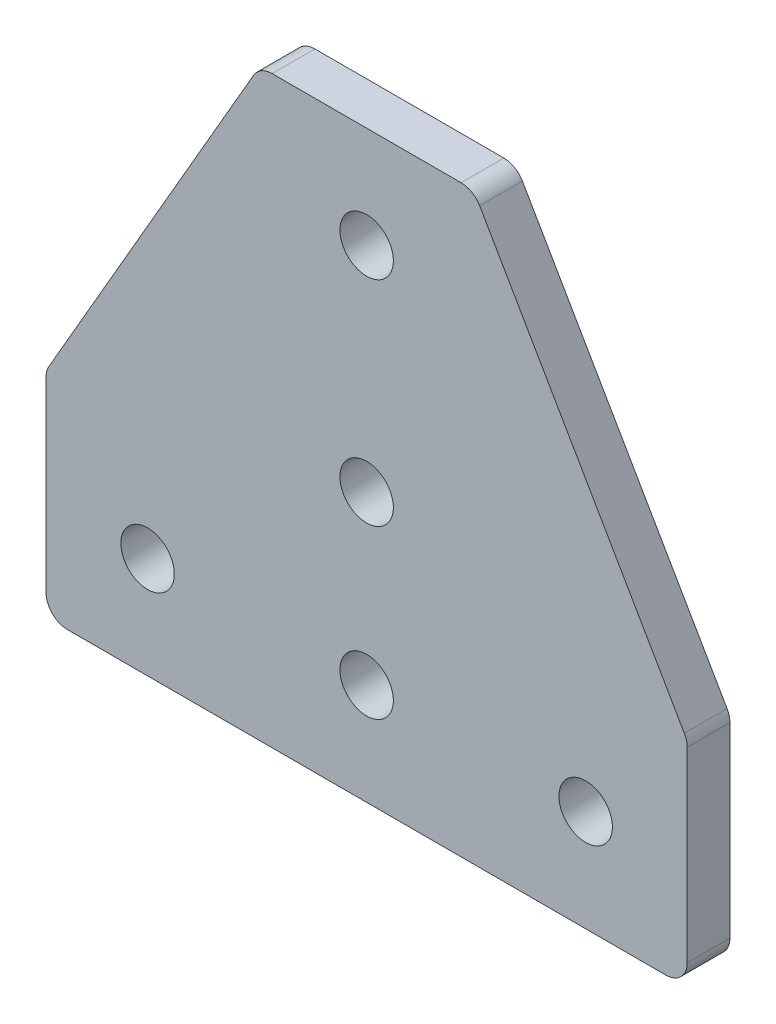
ISO-10303-21;
HEADER;
FILE_DESCRIPTION(('STEP AP214'),'2;1');
FILE_NAME('part.step','',(''),(''),'','','');
FILE_SCHEMA(('AUTOMOTIVE_DESIGN { 1 0 10303 214 1 1 1 1 }'));
ENDSEC;
DATA;
#1=APPLICATION_CONTEXT('core data for automotive mechanical design processes');
#2=APPLICATION_PROTOCOL_DEFINITION('international standard','automotive_design',2000,#1);
#3=PRODUCT_CONTEXT('',#1,'mechanical');
#4=PRODUCT('Part','Part','',(#3));
#5=PRODUCT_RELATED_PRODUCT_CATEGORY('part','',(#4));
#6=PRODUCT_DEFINITION_FORMATION('','',#4);
#7=PRODUCT_DEFINITION_CONTEXT('part definition',#1,'design');
#8=PRODUCT_DEFINITION('design','',#6,#7);
#9=PRODUCT_DEFINITION_SHAPE('','',#8);
#10=(LENGTH_UNIT() NAMED_UNIT(*) SI_UNIT(.MILLI.,.METRE.));
#11=(NAMED_UNIT(*) PLANE_ANGLE_UNIT() SI_UNIT($,.RADIAN.));
#12=(NAMED_UNIT(*) SI_UNIT($,.STERADIAN.) SOLID_ANGLE_UNIT());
#13=UNCERTAINTY_MEASURE_WITH_UNIT(LENGTH_MEASURE(1.E-05),#10,'distance_accuracy_value','');
#14=(GEOMETRIC_REPRESENTATION_CONTEXT(3) GLOBAL_UNCERTAINTY_ASSIGNED_CONTEXT((#13)) GLOBAL_UNIT_ASSIGNED_CONTEXT((#10,
#11,#12)) REPRESENTATION_CONTEXT('',''));
#15=CARTESIAN_POINT('',(0.,0.,0.));
#16=DIRECTION('',(0.,0.,1.));
#17=DIRECTION('',(1.,0.,0.));
#18=AXIS2_PLACEMENT_3D('',#15,#16,#17);
#19=CARTESIAN_POINT('',(-2.12462870860008,-24.3958817984257,1.20047772650378));
#20=DIRECTION('',(0.,1.,0.));
#21=DIRECTION('',(-1.,0.,0.));
#22=AXIS2_PLACEMENT_3D('',#19,#20,#21);
#23=PLANE('',#22);
#24=DIRECTION('',(1.,0.,0.));
#25=VECTOR('',#24,1.);
#26=CARTESIAN_POINT('',(-2.12462870860008,-24.3958817984257,-2.79952227349622));
#27=LINE('',#26,#25);
#28=CARTESIAN_POINT('',(-30.1246287086001,-24.3958817984257,-2.79952227349622));
#29=VERTEX_POINT('',#28);
#30=CARTESIAN_POINT('',(25.8753712913999,-24.3958817984257,-2.79952227349622));
#31=VERTEX_POINT('',#30);
#32=EDGE_CURVE('E202',#29,#31,#27,.T.);
#33=ORIENTED_EDGE('',*,*,#32,.T.);
#34=DIRECTION('',(0.,0.,-1.));
#35=VECTOR('',#34,1.);
#36=CARTESIAN_POINT('',(25.8753712913999,-24.3958817984257,1.20047772650378));
#37=LINE('',#36,#35);
#38=CARTESIAN_POINT('',(25.8753712913999,-24.3958817984257,1.20047772650378));
#39=VERTEX_POINT('',#38);
#40=EDGE_CURVE('E127',#31,#39,#37,.F.);
#41=ORIENTED_EDGE('',*,*,#40,.T.);
#42=DIRECTION('',(1.,0.,0.));
#43=VECTOR('',#42,1.);
#44=CARTESIAN_POINT('',(-2.12462870860008,-24.3958817984257,1.20047772650378));
#45=LINE('',#44,#43);
#46=CARTESIAN_POINT('',(-30.1246287086001,-24.3958817984257,1.20047772650378));
#47=VERTEX_POINT('',#46);
#48=EDGE_CURVE('E197',#47,#39,#45,.T.);
#49=ORIENTED_EDGE('',*,*,#48,.F.);
#50=DIRECTION('',(0.,0.,-1.));
#51=VECTOR('',#50,1.);
#52=CARTESIAN_POINT('',(-30.1246287086001,-24.3958817984257,1.20047772650378));
#53=LINE('',#52,#51);
#54=EDGE_CURVE('E128',#47,#29,#53,.T.);
#55=ORIENTED_EDGE('',*,*,#54,.T.);
#56=EDGE_LOOP('',(#33,#41,#49,#55));
#57=FACE_BOUND('',#56,.T.);
#58=ADVANCED_FACE('F16',(#57),#23,.F.);
#59=CARTESIAN_POINT('',(-12.1246287086001,30.2451343529519,1.20047772650378));
#60=DIRECTION('',(0.,-1.,0.));
#61=DIRECTION('',(0.,0.,-1.));
#62=AXIS2_PLACEMENT_3D('',#59,#60,#61);
#63=PLANE('',#62);
#64=DIRECTION('',(-1.,0.,0.));
#65=VECTOR('',#64,1.);
#66=CARTESIAN_POINT('',(-12.1246287086001,30.2451343529519,-2.79952227349622));
#67=LINE('',#66,#65);
#68=CARTESIAN_POINT('',(6.72067075302066,30.2451343529519,-2.79952227349622));
#69=VERTEX_POINT('',#68);
#70=CARTESIAN_POINT('',(-10.9699281702208,30.2451343529519,-2.79952227349622));
#71=VERTEX_POINT('',#70);
#72=EDGE_CURVE('E204',#69,#71,#67,.T.);
#73=ORIENTED_EDGE('',*,*,#72,.T.);
#74=DIRECTION('',(0.,0.,-1.));
#75=VECTOR('',#74,1.);
#76=CARTESIAN_POINT('',(-10.9699281702208,30.2451343529519,1.20047772650378));
#77=LINE('',#76,#75);
#78=CARTESIAN_POINT('',(-10.9699281702208,30.2451343529519,1.20047772650378));
#79=VERTEX_POINT('',#78);
#80=EDGE_CURVE('E169',#71,#79,#77,.F.);
#81=ORIENTED_EDGE('',*,*,#80,.T.);
#82=DIRECTION('',(-1.,0.,0.));
#83=VECTOR('',#82,1.);
#84=CARTESIAN_POINT('',(-12.1246287086001,30.2451343529519,1.20047772650378));
#85=LINE('',#84,#83);
#86=CARTESIAN_POINT('',(6.72067075302066,30.2451343529519,1.20047772650378));
#87=VERTEX_POINT('',#86);
#88=EDGE_CURVE('E199',#87,#79,#85,.T.);
#89=ORIENTED_EDGE('',*,*,#88,.F.);
#90=DIRECTION('',(0.,0.,-1.));
#91=VECTOR('',#90,1.);
#92=CARTESIAN_POINT('',(6.72067075302066,30.2451343529519,-2.79952227349622));
#93=LINE('',#92,#91);
#94=EDGE_CURVE('E166',#87,#69,#93,.T.);
#95=ORIENTED_EDGE('',*,*,#94,.T.);
#96=EDGE_LOOP('',(#73,#81,#89,#95));
#97=FACE_BOUND('',#96,.T.);
#98=ADVANCED_FACE('F222',(#97),#63,.F.);
#99=CARTESIAN_POINT('',(-32.1246287086001,-4.39588179842569,1.20047772650378));
#100=DIRECTION('',(0.866025403784439,-0.5,0.));
#101=DIRECTION('',(0.5,0.866025403784439,0.));
#102=AXIS2_PLACEMENT_3D('',#99,#100,#101);
#103=PLANE('',#102);
#104=DIRECTION('',(-0.5,-0.866025403784439,0.));
#105=VECTOR('',#104,1.);
#106=CARTESIAN_POINT('',(-32.1246287086001,-4.39588179842569,1.20047772650378));
#107=LINE('',#106,#105);
#108=CARTESIAN_POINT('',(-12.7019789777897,29.2451343529518,1.20047772650378));
#109=VERTEX_POINT('',#108);
#110=CARTESIAN_POINT('',(-31.856679516169,-3.93178018328793,1.20047772650378));
#111=VERTEX_POINT('',#110);
#112=EDGE_CURVE('E138',#109,#111,#107,.T.);
#113=ORIENTED_EDGE('',*,*,#112,.F.);
#114=DIRECTION('',(0.,0.,-1.));
#115=VECTOR('',#114,1.);
#116=CARTESIAN_POINT('',(-12.7019789777897,29.2451343529519,1.20047772650378));
#117=LINE('',#116,#115);
#118=CARTESIAN_POINT('',(-12.7019789777897,29.2451343529518,-2.79952227349622));
#119=VERTEX_POINT('',#118);
#120=EDGE_CURVE('E156',#109,#119,#117,.T.);
#121=ORIENTED_EDGE('',*,*,#120,.T.);
#122=DIRECTION('',(-0.5,-0.866025403784439,0.));
#123=VECTOR('',#122,1.);
#124=CARTESIAN_POINT('',(-32.1246287086001,-4.39588179842569,-2.79952227349622));
#125=LINE('',#124,#123);
#126=CARTESIAN_POINT('',(-31.856679516169,-3.93178018328793,-2.79952227349622));
#127=VERTEX_POINT('',#126);
#128=EDGE_CURVE('E206',#119,#127,#125,.T.);
#129=ORIENTED_EDGE('',*,*,#128,.T.);
#130=DIRECTION('',(0.,0.,-1.));
#131=VECTOR('',#130,1.);
#132=CARTESIAN_POINT('',(-31.856679516169,-3.93178018328793,1.20047772650378));
#133=LINE('',#132,#131);
#134=EDGE_CURVE('E154',#127,#111,#133,.F.);
#135=ORIENTED_EDGE('',*,*,#134,.T.);
#136=EDGE_LOOP('',(#113,#121,#129,#135));
#137=FACE_BOUND('',#136,.T.);
#138=ADVANCED_FACE('F228',(#137),#103,.F.);
#139=CARTESIAN_POINT('',(-32.1246287086001,-24.3958817984257,1.20047772650378));
#140=DIRECTION('',(1.,0.,0.));
#141=DIRECTION('',(0.,0.,-1.));
#142=AXIS2_PLACEMENT_3D('',#139,#140,#141);
#143=PLANE('',#142);
#144=DIRECTION('',(0.,-1.,0.));
#145=VECTOR('',#144,1.);
#146=CARTESIAN_POINT('',(-32.1246287086001,-24.3958817984257,1.20047772650378));
#147=LINE('',#146,#145);
#148=CARTESIAN_POINT('',(-32.1246287086001,-4.93178018328793,1.20047772650378));
#149=VERTEX_POINT('',#148);
#150=CARTESIAN_POINT('',(-32.1246287086001,-22.3958817984257,1.20047772650378));
#151=VERTEX_POINT('',#150);
#152=EDGE_CURVE('E134',#149,#151,#147,.T.);
#153=ORIENTED_EDGE('',*,*,#152,.F.);
#154=DIRECTION('',(0.,0.,-1.));
#155=VECTOR('',#154,1.);
#156=CARTESIAN_POINT('',(-32.1246287086001,-4.93178018328793,1.20047772650378));
#157=LINE('',#156,#155);
#158=CARTESIAN_POINT('',(-32.1246287086001,-4.93178018328793,-2.79952227349622));
#159=VERTEX_POINT('',#158);
#160=EDGE_CURVE('E10',#149,#159,#157,.T.);
#161=ORIENTED_EDGE('',*,*,#160,.T.);
#162=DIRECTION('',(0.,-1.,0.));
#163=VECTOR('',#162,1.);
#164=CARTESIAN_POINT('',(-32.1246287086001,-24.3958817984257,-2.79952227349622));
#165=LINE('',#164,#163);
#166=CARTESIAN_POINT('',(-32.1246287086001,-22.3958817984257,-2.79952227349622));
#167=VERTEX_POINT('',#166);
#168=EDGE_CURVE('E141',#159,#167,#165,.T.);
#169=ORIENTED_EDGE('',*,*,#168,.T.);
#170=DIRECTION('',(0.,0.,-1.));
#171=VECTOR('',#170,1.);
#172=CARTESIAN_POINT('',(-32.1246287086001,-22.3958817984257,1.20047772650378));
#173=LINE('',#172,#171);
#174=EDGE_CURVE('E151',#167,#151,#173,.F.);
#175=ORIENTED_EDGE('',*,*,#174,.T.);
#176=EDGE_LOOP('',(#153,#161,#169,#175));
#177=FACE_BOUND('',#176,.T.);
#178=ADVANCED_FACE('F212',(#177),#143,.F.);
#179=CARTESIAN_POINT('',(-32.1246287086001,-24.3958817984257,1.20047772650378));
#180=DIRECTION('',(0.,0.,-1.));
#181=DIRECTION('',(-1.,0.,0.));
#182=AXIS2_PLACEMENT_3D('',#179,#180,#181);
#183=PLANE('',#182);
#184=CARTESIAN_POINT('',(-2.12462870860008,20.7451343529519,1.20047772650378));
#185=DIRECTION('',(0.,0.,-1.));
#186=DIRECTION('',(-1.,0.,0.));
#187=AXIS2_PLACEMENT_3D('',#184,#185,#186);
#188=CIRCLE('',#187,2.5);
#189=CARTESIAN_POINT('',(-4.62462870860008,20.7451343529519,1.20047772650378));
#190=VERTEX_POINT('',#189);
#191=EDGE_CURVE('E318',#190,#190,#188,.T.);
#192=ORIENTED_EDGE('',*,*,#191,.T.);
#193=EDGE_LOOP('',(#192));
#194=FACE_BOUND('',#193,.T.);
#195=CARTESIAN_POINT('',(-2.12462870860008,0.745134352951864,1.20047772650378));
#196=DIRECTION('',(0.,0.,-1.));
#197=DIRECTION('',(-1.,0.,0.));
#198=AXIS2_PLACEMENT_3D('',#195,#196,#197);
#199=CIRCLE('',#198,2.5);
#200=CARTESIAN_POINT('',(-4.62462870860008,0.745134352951864,1.20047772650378));
#201=VERTEX_POINT('',#200);
#202=EDGE_CURVE('E312',#201,#201,#199,.T.);
#203=ORIENTED_EDGE('',*,*,#202,.T.);
#204=EDGE_LOOP('',(#203));
#205=FACE_BOUND('',#204,.T.);
#206=CARTESIAN_POINT('',(18.3753712913999,-14.8958817984257,1.20047772650378));
#207=DIRECTION('',(0.,0.,-1.));
#208=DIRECTION('',(-1.,0.,0.));
#209=AXIS2_PLACEMENT_3D('',#206,#207,#208);
#210=CIRCLE('',#209,2.5);
#211=CARTESIAN_POINT('',(15.8753712913999,-14.8958817984257,1.20047772650378));
#212=VERTEX_POINT('',#211);
#213=EDGE_CURVE('E302',#212,#212,#210,.T.);
#214=ORIENTED_EDGE('',*,*,#213,.T.);
#215=EDGE_LOOP('',(#214));
#216=FACE_BOUND('',#215,.T.);
#217=CARTESIAN_POINT('',(-22.6246287086001,-14.8958817984257,1.20047772650378));
#218=DIRECTION('',(0.,0.,-1.));
#219=DIRECTION('',(-1.,0.,0.));
#220=AXIS2_PLACEMENT_3D('',#217,#218,#219);
#221=CIRCLE('',#220,2.5);
#222=CARTESIAN_POINT('',(-25.1246287086001,-14.8958817984257,1.20047772650378));
#223=VERTEX_POINT('',#222);
#224=EDGE_CURVE('E297',#223,#223,#221,.T.);
#225=ORIENTED_EDGE('',*,*,#224,.T.);
#226=EDGE_LOOP('',(#225));
#227=FACE_BOUND('',#226,.T.);
#228=CARTESIAN_POINT('',(-2.12462870860008,-14.8958817984257,1.20047772650378));
#229=DIRECTION('',(0.,0.,-1.));
#230=DIRECTION('',(-1.,0.,0.));
#231=AXIS2_PLACEMENT_3D('',#228,#229,#230);
#232=CIRCLE('',#231,2.5);
#233=CARTESIAN_POINT('',(-4.62462870860008,-14.8958817984257,1.20047772650378));
#234=VERTEX_POINT('',#233);
#235=EDGE_CURVE('E119',#234,#234,#232,.T.);
#236=ORIENTED_EDGE('',*,*,#235,.T.);
#237=EDGE_LOOP('',(#236));
#238=FACE_BOUND('',#237,.T.);
#239=ORIENTED_EDGE('',*,*,#88,.T.);
#240=CARTESIAN_POINT('',(-10.9699281702208,28.2451343529519,1.20047772650378));
#241=DIRECTION('',(0.,0.,-1.));
#242=DIRECTION('',(-1.,0.,0.));
#243=AXIS2_PLACEMENT_3D('',#240,#241,#242);
#244=CIRCLE('',#243,2.);
#245=EDGE_CURVE('E175',#79,#109,#244,.F.);
#246=ORIENTED_EDGE('',*,*,#245,.T.);
#247=ORIENTED_EDGE('',*,*,#112,.T.);
#248=CARTESIAN_POINT('',(-30.1246287086001,-4.93178018328793,1.20047772650378));
#249=DIRECTION('',(0.,0.,-1.));
#250=DIRECTION('',(-1.,0.,0.));
#251=AXIS2_PLACEMENT_3D('',#248,#249,#250);
#252=CIRCLE('',#251,2.);
#253=EDGE_CURVE('E31',#111,#149,#252,.F.);
#254=ORIENTED_EDGE('',*,*,#253,.T.);
#255=ORIENTED_EDGE('',*,*,#152,.T.);
#256=CARTESIAN_POINT('',(-30.1246287086001,-22.3958817984257,1.20047772650378));
#257=DIRECTION('',(0.,0.,-1.));
#258=DIRECTION('',(-1.,0.,0.));
#259=AXIS2_PLACEMENT_3D('',#256,#257,#258);
#260=CIRCLE('',#259,2.);
#261=EDGE_CURVE('E147',#151,#47,#260,.F.);
#262=ORIENTED_EDGE('',*,*,#261,.T.);
#263=ORIENTED_EDGE('',*,*,#48,.T.);
#264=CARTESIAN_POINT('',(25.8753712913999,-22.3958817984257,1.20047772650378));
#265=DIRECTION('',(0.,0.,-1.));
#266=DIRECTION('',(-1.,0.,0.));
#267=AXIS2_PLACEMENT_3D('',#264,#265,#266);
#268=CIRCLE('',#267,2.);
#269=CARTESIAN_POINT('',(27.8753712913999,-22.3958817984257,1.20047772650378));
#270=VERTEX_POINT('',#269);
#271=EDGE_CURVE('E149',#39,#270,#268,.F.);
#272=ORIENTED_EDGE('',*,*,#271,.T.);
#273=DIRECTION('',(0.,-1.,0.));
#274=VECTOR('',#273,1.);
#275=CARTESIAN_POINT('',(27.8753712913999,-24.3958817984257,1.20047772650378));
#276=LINE('',#275,#274);
#277=CARTESIAN_POINT('',(27.8753712913999,-4.93178018328793,1.20047772650378));
#278=VERTEX_POINT('',#277);
#279=EDGE_CURVE('E132',#278,#270,#276,.T.);
#280=ORIENTED_EDGE('',*,*,#279,.F.);
#281=CARTESIAN_POINT('',(25.8753712913999,-4.93178018328793,1.20047772650378));
#282=DIRECTION('',(0.,0.,-1.));
#283=DIRECTION('',(-1.,0.,0.));
#284=AXIS2_PLACEMENT_3D('',#281,#282,#283);
#285=CIRCLE('',#284,2.);
#286=CARTESIAN_POINT('',(27.6074220989688,-3.93178018328793,1.20047772650378));
#287=VERTEX_POINT('',#286);
#288=EDGE_CURVE('E38',#278,#287,#285,.F.);
#289=ORIENTED_EDGE('',*,*,#288,.T.);
#290=DIRECTION('',(0.5,-0.866025403784439,0.));
#291=VECTOR('',#290,1.);
#292=CARTESIAN_POINT('',(27.8753712913999,-4.39588179842569,1.20047772650378));
#293=LINE('',#292,#291);
#294=CARTESIAN_POINT('',(8.45272156058954,29.2451343529518,1.20047772650378));
#295=VERTEX_POINT('',#294);
#296=EDGE_CURVE('E185',#295,#287,#293,.T.);
#297=ORIENTED_EDGE('',*,*,#296,.F.);
#298=CARTESIAN_POINT('',(6.72067075302066,28.2451343529519,1.20047772650378));
#299=DIRECTION('',(0.,0.,-1.));
#300=DIRECTION('',(-1.,0.,0.));
#301=AXIS2_PLACEMENT_3D('',#298,#299,#300);
#302=CIRCLE('',#301,2.);
#303=EDGE_CURVE('E173',#295,#87,#302,.F.);
#304=ORIENTED_EDGE('',*,*,#303,.T.);
#305=EDGE_LOOP('',(#239,#246,#247,#254,#255,#262,#263,#272,#280,#289,#297,#304));
#306=FACE_BOUND('',#305,.T.);
#307=ADVANCED_FACE('F183',(#194,#205,#216,#227,#238,#306),#183,.F.);
#308=CARTESIAN_POINT('',(-32.1246287086001,-24.3958817984257,-2.79952227349622));
#309=DIRECTION('',(0.,0.,-1.));
#310=DIRECTION('',(-1.,0.,0.));
#311=AXIS2_PLACEMENT_3D('',#308,#309,#310);
#312=PLANE('',#311);
#313=CARTESIAN_POINT('',(-2.12462870860008,20.7451343529519,-2.79952227349622));
#314=DIRECTION('',(0.,0.,-1.));
#315=DIRECTION('',(-1.,0.,0.));
#316=AXIS2_PLACEMENT_3D('',#313,#314,#315);
#317=CIRCLE('',#316,2.5);
#318=CARTESIAN_POINT('',(-4.62462870860008,20.7451343529519,-2.79952227349622));
#319=VERTEX_POINT('',#318);
#320=EDGE_CURVE('E321',#319,#319,#317,.T.);
#321=ORIENTED_EDGE('',*,*,#320,.F.);
#322=EDGE_LOOP('',(#321));
#323=FACE_BOUND('',#322,.T.);
#324=CARTESIAN_POINT('',(-2.12462870860008,0.745134352951864,-2.79952227349622));
#325=DIRECTION('',(0.,0.,-1.));
#326=DIRECTION('',(-1.,0.,0.));
#327=AXIS2_PLACEMENT_3D('',#324,#325,#326);
#328=CIRCLE('',#327,2.5);
#329=CARTESIAN_POINT('',(-4.62462870860008,0.745134352951864,-2.79952227349622));
#330=VERTEX_POINT('',#329);
#331=EDGE_CURVE('E315',#330,#330,#328,.T.);
#332=ORIENTED_EDGE('',*,*,#331,.F.);
#333=EDGE_LOOP('',(#332));
#334=FACE_BOUND('',#333,.T.);
#335=CARTESIAN_POINT('',(18.3753712913999,-14.8958817984257,-2.79952227349622));
#336=DIRECTION('',(0.,0.,-1.));
#337=DIRECTION('',(-1.,0.,0.));
#338=AXIS2_PLACEMENT_3D('',#335,#336,#337);
#339=CIRCLE('',#338,2.5);
#340=CARTESIAN_POINT('',(15.8753712913999,-14.8958817984257,-2.79952227349622));
#341=VERTEX_POINT('',#340);
#342=EDGE_CURVE('E307',#341,#341,#339,.T.);
#343=ORIENTED_EDGE('',*,*,#342,.F.);
#344=EDGE_LOOP('',(#343));
#345=FACE_BOUND('',#344,.T.);
#346=CARTESIAN_POINT('',(-22.6246287086001,-14.8958817984257,-2.79952227349622));
#347=DIRECTION('',(0.,0.,-1.));
#348=DIRECTION('',(-1.,0.,0.));
#349=AXIS2_PLACEMENT_3D('',#346,#347,#348);
#350=CIRCLE('',#349,2.5);
#351=CARTESIAN_POINT('',(-25.1246287086001,-14.8958817984257,-2.79952227349622));
#352=VERTEX_POINT('',#351);
#353=EDGE_CURVE('E300',#352,#352,#350,.T.);
#354=ORIENTED_EDGE('',*,*,#353,.F.);
#355=EDGE_LOOP('',(#354));
#356=FACE_BOUND('',#355,.T.);
#357=CARTESIAN_POINT('',(-2.12462870860008,-14.8958817984257,-2.79952227349622));
#358=DIRECTION('',(0.,0.,-1.));
#359=DIRECTION('',(-1.,0.,0.));
#360=AXIS2_PLACEMENT_3D('',#357,#358,#359);
#361=CIRCLE('',#360,2.5);
#362=CARTESIAN_POINT('',(-4.62462870860008,-14.8958817984257,-2.79952227349622));
#363=VERTEX_POINT('',#362);
#364=EDGE_CURVE('E304',#363,#363,#361,.T.);
#365=ORIENTED_EDGE('',*,*,#364,.F.);
#366=EDGE_LOOP('',(#365));
#367=FACE_BOUND('',#366,.T.);
#368=ORIENTED_EDGE('',*,*,#128,.F.);
#369=CARTESIAN_POINT('',(-10.9699281702208,28.2451343529519,-2.79952227349622));
#370=DIRECTION('',(0.,0.,-1.));
#371=DIRECTION('',(-1.,0.,0.));
#372=AXIS2_PLACEMENT_3D('',#369,#370,#371);
#373=CIRCLE('',#372,2.);
#374=EDGE_CURVE('E164',#119,#71,#373,.T.);
#375=ORIENTED_EDGE('',*,*,#374,.T.);
#376=ORIENTED_EDGE('',*,*,#72,.F.);
#377=CARTESIAN_POINT('',(6.72067075302066,28.2451343529519,-2.79952227349622));
#378=DIRECTION('',(0.,0.,-1.));
#379=DIRECTION('',(-1.,0.,0.));
#380=AXIS2_PLACEMENT_3D('',#377,#378,#379);
#381=CIRCLE('',#380,2.);
#382=CARTESIAN_POINT('',(8.45272156058954,29.2451343529518,-2.79952227349622));
#383=VERTEX_POINT('',#382);
#384=EDGE_CURVE('E162',#69,#383,#381,.T.);
#385=ORIENTED_EDGE('',*,*,#384,.T.);
#386=DIRECTION('',(0.5,-0.866025403784439,0.));
#387=VECTOR('',#386,1.);
#388=CARTESIAN_POINT('',(27.8753712913999,-4.39588179842569,-2.79952227349622));
#389=LINE('',#388,#387);
#390=CARTESIAN_POINT('',(27.6074220989688,-3.93178018328793,-2.79952227349622));
#391=VERTEX_POINT('',#390);
#392=EDGE_CURVE('E118',#383,#391,#389,.T.);
#393=ORIENTED_EDGE('',*,*,#392,.T.);
#394=CARTESIAN_POINT('',(25.8753712913999,-4.93178018328793,-2.79952227349622));
#395=DIRECTION('',(0.,0.,-1.));
#396=DIRECTION('',(-1.,0.,0.));
#397=AXIS2_PLACEMENT_3D('',#394,#395,#396);
#398=CIRCLE('',#397,2.);
#399=CARTESIAN_POINT('',(27.8753712913999,-4.93178018328793,-2.79952227349622));
#400=VERTEX_POINT('',#399);
#401=EDGE_CURVE('E114',#391,#400,#398,.T.);
#402=ORIENTED_EDGE('',*,*,#401,.T.);
#403=DIRECTION('',(0.,-1.,0.));
#404=VECTOR('',#403,1.);
#405=CARTESIAN_POINT('',(27.8753712913999,-24.3958817984257,-2.79952227349622));
#406=LINE('',#405,#404);
#407=CARTESIAN_POINT('',(27.8753712913999,-22.3958817984257,-2.79952227349622));
#408=VERTEX_POINT('',#407);
#409=EDGE_CURVE('E106',#400,#408,#406,.T.);
#410=ORIENTED_EDGE('',*,*,#409,.T.);
#411=CARTESIAN_POINT('',(25.8753712913999,-22.3958817984257,-2.79952227349622));
#412=DIRECTION('',(0.,0.,-1.));
#413=DIRECTION('',(-1.,0.,0.));
#414=AXIS2_PLACEMENT_3D('',#411,#412,#413);
#415=CIRCLE('',#414,2.);
#416=EDGE_CURVE('E111',#408,#31,#415,.T.);
#417=ORIENTED_EDGE('',*,*,#416,.T.);
#418=ORIENTED_EDGE('',*,*,#32,.F.);
#419=CARTESIAN_POINT('',(-30.1246287086001,-22.3958817984257,-2.79952227349622));
#420=DIRECTION('',(0.,0.,-1.));
#421=DIRECTION('',(-1.,0.,0.));
#422=AXIS2_PLACEMENT_3D('',#419,#420,#421);
#423=CIRCLE('',#422,2.);
#424=EDGE_CURVE('E129',#29,#167,#423,.T.);
#425=ORIENTED_EDGE('',*,*,#424,.T.);
#426=ORIENTED_EDGE('',*,*,#168,.F.);
#427=CARTESIAN_POINT('',(-30.1246287086001,-4.93178018328793,-2.79952227349622));
#428=DIRECTION('',(0.,0.,-1.));
#429=DIRECTION('',(-1.,0.,0.));
#430=AXIS2_PLACEMENT_3D('',#427,#428,#429);
#431=CIRCLE('',#430,2.);
#432=EDGE_CURVE('E159',#159,#127,#431,.T.);
#433=ORIENTED_EDGE('',*,*,#432,.T.);
#434=EDGE_LOOP('',(#368,#375,#376,#385,#393,#402,#410,#417,#418,#425,#426,#433));
#435=FACE_BOUND('',#434,.T.);
#436=ADVANCED_FACE('F109',(#323,#334,#345,#356,#367,#435),#312,.T.);
#437=CARTESIAN_POINT('',(27.8753712913999,-24.3958817984257,1.20047772650378));
#438=DIRECTION('',(1.,0.,0.));
#439=DIRECTION('',(0.,0.,-1.));
#440=AXIS2_PLACEMENT_3D('',#437,#438,#439);
#441=PLANE('',#440);
#442=ORIENTED_EDGE('',*,*,#409,.F.);
#443=DIRECTION('',(0.,0.,-1.));
#444=VECTOR('',#443,1.);
#445=CARTESIAN_POINT('',(27.8753712913999,-4.93178018328793,1.20047772650378));
#446=LINE('',#445,#444);
#447=EDGE_CURVE('E24',#400,#278,#446,.F.);
#448=ORIENTED_EDGE('',*,*,#447,.T.);
#449=ORIENTED_EDGE('',*,*,#279,.T.);
#450=DIRECTION('',(0.,0.,-1.));
#451=VECTOR('',#450,1.);
#452=CARTESIAN_POINT('',(27.8753712913999,-22.3958817984257,-2.79952227349622));
#453=LINE('',#452,#451);
#454=EDGE_CURVE('E126',#270,#408,#453,.T.);
#455=ORIENTED_EDGE('',*,*,#454,.T.);
#456=EDGE_LOOP('',(#442,#448,#449,#455));
#457=FACE_BOUND('',#456,.T.);
#458=ADVANCED_FACE('F131',(#457),#441,.T.);
#459=CARTESIAN_POINT('',(27.8753712913999,-4.39588179842569,1.20047772650378));
#460=DIRECTION('',(0.866025403784439,0.5,0.));
#461=DIRECTION('',(-0.5,0.866025403784439,0.));
#462=AXIS2_PLACEMENT_3D('',#459,#460,#461);
#463=PLANE('',#462);
#464=ORIENTED_EDGE('',*,*,#392,.F.);
#465=DIRECTION('',(0.,0.,-1.));
#466=VECTOR('',#465,1.);
#467=CARTESIAN_POINT('',(8.45272156058954,29.2451343529519,1.20047772650378));
#468=LINE('',#467,#466);
#469=EDGE_CURVE('E180',#383,#295,#468,.F.);
#470=ORIENTED_EDGE('',*,*,#469,.T.);
#471=ORIENTED_EDGE('',*,*,#296,.T.);
#472=DIRECTION('',(0.,0.,-1.));
#473=VECTOR('',#472,1.);
#474=CARTESIAN_POINT('',(27.6074220989688,-3.93178018328793,1.20047772650378));
#475=LINE('',#474,#473);
#476=EDGE_CURVE('E177',#287,#391,#475,.T.);
#477=ORIENTED_EDGE('',*,*,#476,.T.);
#478=EDGE_LOOP('',(#464,#470,#471,#477));
#479=FACE_BOUND('',#478,.T.);
#480=ADVANCED_FACE('F191',(#479),#463,.T.);
#481=CARTESIAN_POINT('',(25.8753712913999,-22.3958817984257,1.20047772650378));
#482=DIRECTION('',(0.,0.,1.));
#483=DIRECTION('',(1.,0.,0.));
#484=AXIS2_PLACEMENT_3D('',#481,#482,#483);
#485=CYLINDRICAL_SURFACE('',#484,2.);
#486=ORIENTED_EDGE('',*,*,#271,.F.);
#487=ORIENTED_EDGE('',*,*,#40,.F.);
#488=ORIENTED_EDGE('',*,*,#416,.F.);
#489=ORIENTED_EDGE('',*,*,#454,.F.);
#490=EDGE_LOOP('',(#486,#487,#488,#489));
#491=FACE_BOUND('',#490,.T.);
#492=ADVANCED_FACE('F125',(#491),#485,.T.);
#493=CARTESIAN_POINT('',(-30.1246287086001,-22.3958817984257,1.20047772650378));
#494=DIRECTION('',(0.,0.,-1.));
#495=DIRECTION('',(-1.,0.,0.));
#496=AXIS2_PLACEMENT_3D('',#493,#494,#495);
#497=CYLINDRICAL_SURFACE('',#496,2.);
#498=ORIENTED_EDGE('',*,*,#261,.F.);
#499=ORIENTED_EDGE('',*,*,#174,.F.);
#500=ORIENTED_EDGE('',*,*,#424,.F.);
#501=ORIENTED_EDGE('',*,*,#54,.F.);
#502=EDGE_LOOP('',(#498,#499,#500,#501));
#503=FACE_BOUND('',#502,.T.);
#504=ADVANCED_FACE('F218',(#503),#497,.T.);
#505=CARTESIAN_POINT('',(-10.9699281702208,28.2451343529519,1.20047772650378));
#506=DIRECTION('',(0.,0.,-1.));
#507=DIRECTION('',(-1.,0.,0.));
#508=AXIS2_PLACEMENT_3D('',#505,#506,#507);
#509=CYLINDRICAL_SURFACE('',#508,2.);
#510=ORIENTED_EDGE('',*,*,#245,.F.);
#511=ORIENTED_EDGE('',*,*,#80,.F.);
#512=ORIENTED_EDGE('',*,*,#374,.F.);
#513=ORIENTED_EDGE('',*,*,#120,.F.);
#514=EDGE_LOOP('',(#510,#511,#512,#513));
#515=FACE_BOUND('',#514,.T.);
#516=ADVANCED_FACE('F237',(#515),#509,.T.);
#517=CARTESIAN_POINT('',(6.72067075302066,28.2451343529519,1.20047772650378));
#518=DIRECTION('',(0.,0.,1.));
#519=DIRECTION('',(1.,0.,0.));
#520=AXIS2_PLACEMENT_3D('',#517,#518,#519);
#521=CYLINDRICAL_SURFACE('',#520,2.);
#522=ORIENTED_EDGE('',*,*,#303,.F.);
#523=ORIENTED_EDGE('',*,*,#469,.F.);
#524=ORIENTED_EDGE('',*,*,#384,.F.);
#525=ORIENTED_EDGE('',*,*,#94,.F.);
#526=EDGE_LOOP('',(#522,#523,#524,#525));
#527=FACE_BOUND('',#526,.T.);
#528=ADVANCED_FACE('F240',(#527),#521,.T.);
#529=CARTESIAN_POINT('',(25.8753712913999,-4.93178018328793,1.20047772650378));
#530=DIRECTION('',(0.,0.,-1.));
#531=DIRECTION('',(-1.,0.,0.));
#532=AXIS2_PLACEMENT_3D('',#529,#530,#531);
#533=CYLINDRICAL_SURFACE('',#532,2.);
#534=ORIENTED_EDGE('',*,*,#288,.F.);
#535=ORIENTED_EDGE('',*,*,#447,.F.);
#536=ORIENTED_EDGE('',*,*,#401,.F.);
#537=ORIENTED_EDGE('',*,*,#476,.F.);
#538=EDGE_LOOP('',(#534,#535,#536,#537));
#539=FACE_BOUND('',#538,.T.);
#540=ADVANCED_FACE('F188',(#539),#533,.T.);
#541=CARTESIAN_POINT('',(-30.1246287086001,-4.93178018328793,1.20047772650378));
#542=DIRECTION('',(0.,0.,-1.));
#543=DIRECTION('',(-1.,0.,0.));
#544=AXIS2_PLACEMENT_3D('',#541,#542,#543);
#545=CYLINDRICAL_SURFACE('',#544,2.);
#546=ORIENTED_EDGE('',*,*,#253,.F.);
#547=ORIENTED_EDGE('',*,*,#134,.F.);
#548=ORIENTED_EDGE('',*,*,#432,.F.);
#549=ORIENTED_EDGE('',*,*,#160,.F.);
#550=EDGE_LOOP('',(#546,#547,#548,#549));
#551=FACE_BOUND('',#550,.T.);
#552=ADVANCED_FACE('F18',(#551),#545,.T.);
#553=CARTESIAN_POINT('',(-2.12462870860008,-14.8958817984257,1.20047772650378));
#554=DIRECTION('',(0.,0.,-1.));
#555=DIRECTION('',(-1.,0.,0.));
#556=AXIS2_PLACEMENT_3D('',#553,#554,#555);
#557=CYLINDRICAL_SURFACE('',#556,2.5);
#558=ORIENTED_EDGE('',*,*,#235,.F.);
#559=EDGE_LOOP('',(#558));
#560=FACE_BOUND('',#559,.T.);
#561=ORIENTED_EDGE('',*,*,#364,.T.);
#562=EDGE_LOOP('',(#561));
#563=FACE_BOUND('',#562,.T.);
#564=ADVANCED_FACE('F248',(#560,#563),#557,.F.);
#565=CARTESIAN_POINT('',(-22.6246287086001,-14.8958817984257,1.20047772650378));
#566=DIRECTION('',(0.,0.,-1.));
#567=DIRECTION('',(-1.,0.,0.));
#568=AXIS2_PLACEMENT_3D('',#565,#566,#567);
#569=CYLINDRICAL_SURFACE('',#568,2.5);
#570=ORIENTED_EDGE('',*,*,#224,.F.);
#571=EDGE_LOOP('',(#570));
#572=FACE_BOUND('',#571,.T.);
#573=ORIENTED_EDGE('',*,*,#353,.T.);
#574=EDGE_LOOP('',(#573));
#575=FACE_BOUND('',#574,.T.);
#576=ADVANCED_FACE('F253',(#572,#575),#569,.F.);
#577=CARTESIAN_POINT('',(18.3753712913999,-14.8958817984257,1.20047772650378));
#578=DIRECTION('',(0.,0.,-1.));
#579=DIRECTION('',(-1.,0.,0.));
#580=AXIS2_PLACEMENT_3D('',#577,#578,#579);
#581=CYLINDRICAL_SURFACE('',#580,2.5);
#582=ORIENTED_EDGE('',*,*,#213,.F.);
#583=EDGE_LOOP('',(#582));
#584=FACE_BOUND('',#583,.T.);
#585=ORIENTED_EDGE('',*,*,#342,.T.);
#586=EDGE_LOOP('',(#585));
#587=FACE_BOUND('',#586,.T.);
#588=ADVANCED_FACE('F285',(#584,#587),#581,.F.);
#589=CARTESIAN_POINT('',(-2.12462870860008,0.745134352951864,1.20047772650378));
#590=DIRECTION('',(0.,0.,-1.));
#591=DIRECTION('',(-1.,0.,0.));
#592=AXIS2_PLACEMENT_3D('',#589,#590,#591);
#593=CYLINDRICAL_SURFACE('',#592,2.5);
#594=ORIENTED_EDGE('',*,*,#202,.F.);
#595=EDGE_LOOP('',(#594));
#596=FACE_BOUND('',#595,.T.);
#597=ORIENTED_EDGE('',*,*,#331,.T.);
#598=EDGE_LOOP('',(#597));
#599=FACE_BOUND('',#598,.T.);
#600=ADVANCED_FACE('F281',(#596,#599),#593,.F.);
#601=CARTESIAN_POINT('',(-2.12462870860008,20.7451343529519,1.20047772650378));
#602=DIRECTION('',(0.,0.,-1.));
#603=DIRECTION('',(-1.,0.,0.));
#604=AXIS2_PLACEMENT_3D('',#601,#602,#603);
#605=CYLINDRICAL_SURFACE('',#604,2.5);
#606=ORIENTED_EDGE('',*,*,#191,.F.);
#607=EDGE_LOOP('',(#606));
#608=FACE_BOUND('',#607,.T.);
#609=ORIENTED_EDGE('',*,*,#320,.T.);
#610=EDGE_LOOP('',(#609));
#611=FACE_BOUND('',#610,.T.);
#612=ADVANCED_FACE('F278',(#608,#611),#605,.F.);
#613=CLOSED_SHELL('',(#58,#98,#138,#178,#307,#436,#458,#480,#492,#504,#516,#528,#540,#552,#564,
#576,#588,#600,#612));
#614=MANIFOLD_SOLID_BREP('B1',#613);
#615=ADVANCED_BREP_SHAPE_REPRESENTATION('',(#18,#614),#14);
#616=SHAPE_DEFINITION_REPRESENTATION(#9,#615);
ENDSEC;
END-ISO-10303-21;
